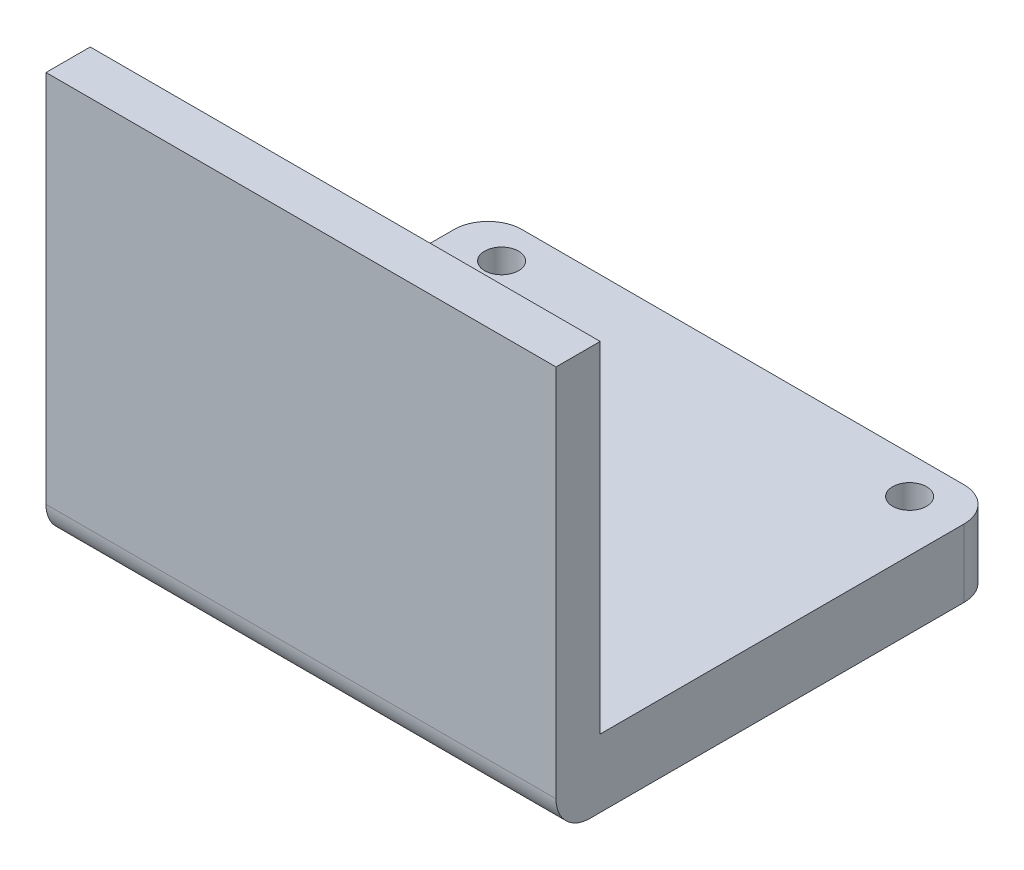
ISO-10303-21;
HEADER;
FILE_DESCRIPTION(('STEP AP214'),'2;1');
FILE_NAME('part.step','',(''),(''),'','','');
FILE_SCHEMA(('AUTOMOTIVE_DESIGN { 1 0 10303 214 1 1 1 1 }'));
ENDSEC;
DATA;
#1=APPLICATION_CONTEXT('core data for automotive mechanical design processes');
#2=APPLICATION_PROTOCOL_DEFINITION('international standard','automotive_design',2000,#1);
#3=PRODUCT_CONTEXT('',#1,'mechanical');
#4=PRODUCT('Part','Part','',(#3));
#5=PRODUCT_RELATED_PRODUCT_CATEGORY('part','',(#4));
#6=PRODUCT_DEFINITION_FORMATION('','',#4);
#7=PRODUCT_DEFINITION_CONTEXT('part definition',#1,'design');
#8=PRODUCT_DEFINITION('design','',#6,#7);
#9=PRODUCT_DEFINITION_SHAPE('','',#8);
#10=(LENGTH_UNIT() NAMED_UNIT(*) SI_UNIT(.MILLI.,.METRE.));
#11=(NAMED_UNIT(*) PLANE_ANGLE_UNIT() SI_UNIT($,.RADIAN.));
#12=(NAMED_UNIT(*) SI_UNIT($,.STERADIAN.) SOLID_ANGLE_UNIT());
#13=UNCERTAINTY_MEASURE_WITH_UNIT(LENGTH_MEASURE(1.E-05),#10,'distance_accuracy_value','');
#14=(GEOMETRIC_REPRESENTATION_CONTEXT(3) GLOBAL_UNCERTAINTY_ASSIGNED_CONTEXT((#13)) GLOBAL_UNIT_ASSIGNED_CONTEXT((#10,
#11,#12)) REPRESENTATION_CONTEXT('',''));
#15=CARTESIAN_POINT('',(0.,0.,0.));
#16=DIRECTION('',(0.,0.,1.));
#17=DIRECTION('',(1.,0.,0.));
#18=AXIS2_PLACEMENT_3D('',#15,#16,#17);
#19=CARTESIAN_POINT('',(0.,10.,0.));
#20=DIRECTION('',(0.,-1.,0.));
#21=DIRECTION('',(0.,0.,-1.));
#22=AXIS2_PLACEMENT_3D('',#19,#20,#21);
#23=PLANE('',#22);
#24=DIRECTION('',(0.,0.,-1.));
#25=VECTOR('',#24,1.);
#26=CARTESIAN_POINT('',(37.5,10.,27.5));
#27=LINE('',#26,#25);
#28=CARTESIAN_POINT('',(37.5,9.99999999999999,31.));
#29=VERTEX_POINT('',#28);
#30=CARTESIAN_POINT('',(37.5,10.,-22.5));
#31=VERTEX_POINT('',#30);
#32=EDGE_CURVE('E186',#29,#31,#27,.T.);
#33=ORIENTED_EDGE('',*,*,#32,.T.);
#34=CARTESIAN_POINT('',(32.5,10.,-22.5));
#35=DIRECTION('',(0.,-1.,0.));
#36=DIRECTION('',(0.,0.,-1.));
#37=AXIS2_PLACEMENT_3D('',#34,#35,#36);
#38=CIRCLE('',#37,5.);
#39=CARTESIAN_POINT('',(32.5,10.,-27.5));
#40=VERTEX_POINT('',#39);
#41=EDGE_CURVE('E50',#31,#40,#38,.F.);
#42=ORIENTED_EDGE('',*,*,#41,.T.);
#43=DIRECTION('',(-1.,0.,0.));
#44=VECTOR('',#43,1.);
#45=CARTESIAN_POINT('',(-37.5,10.,-27.5));
#46=LINE('',#45,#44);
#47=CARTESIAN_POINT('',(-32.5,10.,-27.5));
#48=VERTEX_POINT('',#47);
#49=EDGE_CURVE('E122',#40,#48,#46,.T.);
#50=ORIENTED_EDGE('',*,*,#49,.T.);
#51=CARTESIAN_POINT('',(-32.5,10.,-22.5));
#52=DIRECTION('',(0.,-1.,0.));
#53=DIRECTION('',(0.,0.,-1.));
#54=AXIS2_PLACEMENT_3D('',#51,#52,#53);
#55=CIRCLE('',#54,5.);
#56=CARTESIAN_POINT('',(-37.5,10.,-22.5));
#57=VERTEX_POINT('',#56);
#58=EDGE_CURVE('E57',#48,#57,#55,.F.);
#59=ORIENTED_EDGE('',*,*,#58,.T.);
#60=DIRECTION('',(0.,0.,1.));
#61=VECTOR('',#60,1.);
#62=CARTESIAN_POINT('',(-37.5,10.,27.5));
#63=LINE('',#62,#61);
#64=CARTESIAN_POINT('',(-37.5,9.99999999999999,31.));
#65=VERTEX_POINT('',#64);
#66=EDGE_CURVE('E113',#57,#65,#63,.T.);
#67=ORIENTED_EDGE('',*,*,#66,.T.);
#68=DIRECTION('',(1.,0.,0.));
#69=VECTOR('',#68,1.);
#70=CARTESIAN_POINT('',(-37.5,9.99999999999999,31.));
#71=LINE('',#70,#69);
#72=EDGE_CURVE('E116',#65,#29,#71,.T.);
#73=ORIENTED_EDGE('',*,*,#72,.T.);
#74=EDGE_LOOP('',(#33,#42,#50,#59,#67,#73));
#75=FACE_BOUND('',#74,.T.);
#76=CARTESIAN_POINT('',(-30.,10.,-22.));
#77=DIRECTION('',(0.,1.,0.));
#78=DIRECTION('',(0.,0.,1.));
#79=AXIS2_PLACEMENT_3D('',#76,#77,#78);
#80=CIRCLE('',#79,2.5);
#81=CARTESIAN_POINT('',(-30.,10.,-19.5));
#82=VERTEX_POINT('',#81);
#83=EDGE_CURVE('E178',#82,#82,#80,.T.);
#84=ORIENTED_EDGE('',*,*,#83,.F.);
#85=EDGE_LOOP('',(#84));
#86=FACE_BOUND('',#85,.T.);
#87=CARTESIAN_POINT('',(30.,10.,-22.));
#88=DIRECTION('',(0.,1.,0.));
#89=DIRECTION('',(0.,0.,1.));
#90=AXIS2_PLACEMENT_3D('',#87,#88,#89);
#91=CIRCLE('',#90,2.49999999999999);
#92=CARTESIAN_POINT('',(30.,10.,-19.5));
#93=VERTEX_POINT('',#92);
#94=EDGE_CURVE('E170',#93,#93,#91,.T.);
#95=ORIENTED_EDGE('',*,*,#94,.F.);
#96=EDGE_LOOP('',(#95));
#97=FACE_BOUND('',#96,.T.);
#98=CARTESIAN_POINT('',(0.,10.,18.));
#99=DIRECTION('',(0.,1.,0.));
#100=DIRECTION('',(0.,0.,1.));
#101=AXIS2_PLACEMENT_3D('',#98,#99,#100);
#102=CIRCLE('',#101,2.5);
#103=CARTESIAN_POINT('',(0.,10.,20.5));
#104=VERTEX_POINT('',#103);
#105=EDGE_CURVE('E162',#104,#104,#102,.T.);
#106=ORIENTED_EDGE('',*,*,#105,.F.);
#107=EDGE_LOOP('',(#106));
#108=FACE_BOUND('',#107,.T.);
#109=ADVANCED_FACE('F41',(#75,#86,#97,#108),#23,.F.);
#110=CARTESIAN_POINT('',(0.,0.,0.));
#111=DIRECTION('',(0.,-1.,0.));
#112=DIRECTION('',(0.,0.,-1.));
#113=AXIS2_PLACEMENT_3D('',#110,#111,#112);
#114=PLANE('',#113);
#115=CARTESIAN_POINT('',(30.,0.,-22.));
#116=DIRECTION('',(0.,1.,0.));
#117=DIRECTION('',(0.,0.,1.));
#118=AXIS2_PLACEMENT_3D('',#115,#116,#117);
#119=CIRCLE('',#118,2.49999999999999);
#120=CARTESIAN_POINT('',(30.,0.,-19.5));
#121=VERTEX_POINT('',#120);
#122=EDGE_CURVE('E166',#121,#121,#119,.T.);
#123=ORIENTED_EDGE('',*,*,#122,.T.);
#124=EDGE_LOOP('',(#123));
#125=FACE_BOUND('',#124,.T.);
#126=DIRECTION('',(-1.,0.,0.));
#127=VECTOR('',#126,1.);
#128=CARTESIAN_POINT('',(-37.5,0.,-27.5));
#129=LINE('',#128,#127);
#130=CARTESIAN_POINT('',(32.5,0.,-27.5));
#131=VERTEX_POINT('',#130);
#132=CARTESIAN_POINT('',(-32.5,0.,-27.5));
#133=VERTEX_POINT('',#132);
#134=EDGE_CURVE('E194',#131,#133,#129,.T.);
#135=ORIENTED_EDGE('',*,*,#134,.F.);
#136=CARTESIAN_POINT('',(32.5,0.,-22.5));
#137=DIRECTION('',(0.,-1.,0.));
#138=DIRECTION('',(0.,0.,-1.));
#139=AXIS2_PLACEMENT_3D('',#136,#137,#138);
#140=CIRCLE('',#139,5.);
#141=CARTESIAN_POINT('',(37.5,0.,-22.5));
#142=VERTEX_POINT('',#141);
#143=EDGE_CURVE('E223',#131,#142,#140,.T.);
#144=ORIENTED_EDGE('',*,*,#143,.T.);
#145=DIRECTION('',(0.,0.,-1.));
#146=VECTOR('',#145,1.);
#147=CARTESIAN_POINT('',(37.5,0.,27.5));
#148=LINE('',#147,#146);
#149=CARTESIAN_POINT('',(37.5,0.,32.5));
#150=VERTEX_POINT('',#149);
#151=EDGE_CURVE('E182',#150,#142,#148,.T.);
#152=ORIENTED_EDGE('',*,*,#151,.F.);
#153=DIRECTION('',(1.,0.,0.));
#154=VECTOR('',#153,1.);
#155=CARTESIAN_POINT('',(-37.5,0.,32.5));
#156=LINE('',#155,#154);
#157=CARTESIAN_POINT('',(-37.5,0.,32.5));
#158=VERTEX_POINT('',#157);
#159=EDGE_CURVE('E206',#150,#158,#156,.F.);
#160=ORIENTED_EDGE('',*,*,#159,.T.);
#161=DIRECTION('',(0.,0.,1.));
#162=VECTOR('',#161,1.);
#163=CARTESIAN_POINT('',(-37.5,0.,27.5));
#164=LINE('',#163,#162);
#165=CARTESIAN_POINT('',(-37.5,0.,-22.5));
#166=VERTEX_POINT('',#165);
#167=EDGE_CURVE('E189',#166,#158,#164,.T.);
#168=ORIENTED_EDGE('',*,*,#167,.F.);
#169=CARTESIAN_POINT('',(-32.5,0.,-22.5));
#170=DIRECTION('',(0.,-1.,0.));
#171=DIRECTION('',(0.,0.,-1.));
#172=AXIS2_PLACEMENT_3D('',#169,#170,#171);
#173=CIRCLE('',#172,5.);
#174=EDGE_CURVE('E220',#166,#133,#173,.T.);
#175=ORIENTED_EDGE('',*,*,#174,.T.);
#176=EDGE_LOOP('',(#135,#144,#152,#160,#168,#175));
#177=FACE_BOUND('',#176,.T.);
#178=CARTESIAN_POINT('',(-30.,0.,-22.));
#179=DIRECTION('',(0.,1.,0.));
#180=DIRECTION('',(0.,0.,1.));
#181=AXIS2_PLACEMENT_3D('',#178,#179,#180);
#182=CIRCLE('',#181,2.5);
#183=CARTESIAN_POINT('',(-30.,0.,-19.5));
#184=VERTEX_POINT('',#183);
#185=EDGE_CURVE('E174',#184,#184,#182,.T.);
#186=ORIENTED_EDGE('',*,*,#185,.T.);
#187=EDGE_LOOP('',(#186));
#188=FACE_BOUND('',#187,.T.);
#189=CARTESIAN_POINT('',(0.,0.,18.));
#190=DIRECTION('',(0.,1.,0.));
#191=DIRECTION('',(0.,0.,1.));
#192=AXIS2_PLACEMENT_3D('',#189,#190,#191);
#193=CIRCLE('',#192,2.5);
#194=CARTESIAN_POINT('',(0.,0.,20.5));
#195=VERTEX_POINT('',#194);
#196=EDGE_CURVE('E161',#195,#195,#193,.T.);
#197=ORIENTED_EDGE('',*,*,#196,.T.);
#198=EDGE_LOOP('',(#197));
#199=FACE_BOUND('',#198,.T.);
#200=ADVANCED_FACE('F241',(#125,#177,#188,#199),#114,.T.);
#201=CARTESIAN_POINT('',(37.5,10.,27.5));
#202=DIRECTION('',(-1.,0.,0.));
#203=DIRECTION('',(0.,0.,1.));
#204=AXIS2_PLACEMENT_3D('',#201,#202,#203);
#205=PLANE('',#204);
#206=ORIENTED_EDGE('',*,*,#151,.T.);
#207=DIRECTION('',(0.,-1.,0.));
#208=VECTOR('',#207,1.);
#209=CARTESIAN_POINT('',(37.5,10.,-22.5));
#210=LINE('',#209,#208);
#211=EDGE_CURVE('E65',#142,#31,#210,.F.);
#212=ORIENTED_EDGE('',*,*,#211,.T.);
#213=ORIENTED_EDGE('',*,*,#32,.F.);
#214=DIRECTION('',(0.,1.,0.));
#215=VECTOR('',#214,1.);
#216=CARTESIAN_POINT('',(37.5,9.99999999999999,31.));
#217=LINE('',#216,#215);
#218=CARTESIAN_POINT('',(37.5,60.,31.));
#219=VERTEX_POINT('',#218);
#220=EDGE_CURVE('E130',#29,#219,#217,.T.);
#221=ORIENTED_EDGE('',*,*,#220,.T.);
#222=DIRECTION('',(0.,0.,-1.));
#223=VECTOR('',#222,1.);
#224=CARTESIAN_POINT('',(37.5,60.,27.5));
#225=LINE('',#224,#223);
#226=CARTESIAN_POINT('',(37.5,60.,37.5));
#227=VERTEX_POINT('',#226);
#228=EDGE_CURVE('E149',#227,#219,#225,.T.);
#229=ORIENTED_EDGE('',*,*,#228,.F.);
#230=DIRECTION('',(0.,-1.,0.));
#231=VECTOR('',#230,1.);
#232=CARTESIAN_POINT('',(37.5,60.,37.5));
#233=LINE('',#232,#231);
#234=CARTESIAN_POINT('',(37.5,5.,37.5));
#235=VERTEX_POINT('',#234);
#236=EDGE_CURVE('E153',#227,#235,#233,.T.);
#237=ORIENTED_EDGE('',*,*,#236,.T.);
#238=CARTESIAN_POINT('',(37.5,5.,32.5));
#239=DIRECTION('',(-1.,0.,0.));
#240=DIRECTION('',(0.,0.,1.));
#241=AXIS2_PLACEMENT_3D('',#238,#239,#240);
#242=CIRCLE('',#241,5.);
#243=EDGE_CURVE('E203',#235,#150,#242,.F.);
#244=ORIENTED_EDGE('',*,*,#243,.T.);
#245=EDGE_LOOP('',(#206,#212,#213,#221,#229,#237,#244));
#246=FACE_BOUND('',#245,.T.);
#247=ADVANCED_FACE('F244',(#246),#205,.F.);
#248=CARTESIAN_POINT('',(-37.5,10.,-27.5));
#249=DIRECTION('',(0.,0.,1.));
#250=DIRECTION('',(1.,0.,0.));
#251=AXIS2_PLACEMENT_3D('',#248,#249,#250);
#252=PLANE('',#251);
#253=ORIENTED_EDGE('',*,*,#49,.F.);
#254=DIRECTION('',(0.,-1.,0.));
#255=VECTOR('',#254,1.);
#256=CARTESIAN_POINT('',(32.5,10.,-27.5));
#257=LINE('',#256,#255);
#258=EDGE_CURVE('E216',#40,#131,#257,.T.);
#259=ORIENTED_EDGE('',*,*,#258,.T.);
#260=ORIENTED_EDGE('',*,*,#134,.T.);
#261=DIRECTION('',(0.,-1.,0.));
#262=VECTOR('',#261,1.);
#263=CARTESIAN_POINT('',(-32.5,10.,-27.5));
#264=LINE('',#263,#262);
#265=EDGE_CURVE('E213',#133,#48,#264,.F.);
#266=ORIENTED_EDGE('',*,*,#265,.T.);
#267=EDGE_LOOP('',(#253,#259,#260,#266));
#268=FACE_BOUND('',#267,.T.);
#269=ADVANCED_FACE('F235',(#268),#252,.F.);
#270=CARTESIAN_POINT('',(-37.5,10.,27.5));
#271=DIRECTION('',(1.,0.,0.));
#272=DIRECTION('',(0.,0.,-1.));
#273=AXIS2_PLACEMENT_3D('',#270,#271,#272);
#274=PLANE('',#273);
#275=ORIENTED_EDGE('',*,*,#66,.F.);
#276=DIRECTION('',(0.,-1.,0.));
#277=VECTOR('',#276,1.);
#278=CARTESIAN_POINT('',(-37.5,10.,-22.5));
#279=LINE('',#278,#277);
#280=EDGE_CURVE('E11',#57,#166,#279,.T.);
#281=ORIENTED_EDGE('',*,*,#280,.T.);
#282=ORIENTED_EDGE('',*,*,#167,.T.);
#283=CARTESIAN_POINT('',(-37.5,5.,32.5));
#284=DIRECTION('',(1.,0.,0.));
#285=DIRECTION('',(0.,0.,-1.));
#286=AXIS2_PLACEMENT_3D('',#283,#284,#285);
#287=CIRCLE('',#286,5.);
#288=CARTESIAN_POINT('',(-37.5,5.,37.5));
#289=VERTEX_POINT('',#288);
#290=EDGE_CURVE('E210',#158,#289,#287,.F.);
#291=ORIENTED_EDGE('',*,*,#290,.T.);
#292=DIRECTION('',(0.,-1.,0.));
#293=VECTOR('',#292,1.);
#294=CARTESIAN_POINT('',(-37.5,60.,37.5));
#295=LINE('',#294,#293);
#296=CARTESIAN_POINT('',(-37.5,60.,37.5));
#297=VERTEX_POINT('',#296);
#298=EDGE_CURVE('E157',#297,#289,#295,.T.);
#299=ORIENTED_EDGE('',*,*,#298,.F.);
#300=DIRECTION('',(0.,0.,1.));
#301=VECTOR('',#300,1.);
#302=CARTESIAN_POINT('',(-37.5,60.,27.5));
#303=LINE('',#302,#301);
#304=CARTESIAN_POINT('',(-37.5,60.,31.));
#305=VERTEX_POINT('',#304);
#306=EDGE_CURVE('E137',#305,#297,#303,.T.);
#307=ORIENTED_EDGE('',*,*,#306,.F.);
#308=DIRECTION('',(0.,1.,0.));
#309=VECTOR('',#308,1.);
#310=CARTESIAN_POINT('',(-37.5,9.99999999999999,31.));
#311=LINE('',#310,#309);
#312=EDGE_CURVE('E127',#65,#305,#311,.T.);
#313=ORIENTED_EDGE('',*,*,#312,.F.);
#314=EDGE_LOOP('',(#275,#281,#282,#291,#299,#307,#313));
#315=FACE_BOUND('',#314,.T.);
#316=ADVANCED_FACE('F135',(#315),#274,.F.);
#317=CARTESIAN_POINT('',(-30.,10.,-22.));
#318=DIRECTION('',(0.,-1.,0.));
#319=DIRECTION('',(0.,0.,-1.));
#320=AXIS2_PLACEMENT_3D('',#317,#318,#319);
#321=CYLINDRICAL_SURFACE('',#320,2.5);
#322=ORIENTED_EDGE('',*,*,#83,.T.);
#323=EDGE_LOOP('',(#322));
#324=FACE_BOUND('',#323,.T.);
#325=ORIENTED_EDGE('',*,*,#185,.F.);
#326=EDGE_LOOP('',(#325));
#327=FACE_BOUND('',#326,.T.);
#328=ADVANCED_FACE('F268',(#324,#327),#321,.F.);
#329=CARTESIAN_POINT('',(30.,10.,-22.));
#330=DIRECTION('',(0.,-1.,0.));
#331=DIRECTION('',(0.,0.,-1.));
#332=AXIS2_PLACEMENT_3D('',#329,#330,#331);
#333=CYLINDRICAL_SURFACE('',#332,2.49999999999999);
#334=ORIENTED_EDGE('',*,*,#94,.T.);
#335=EDGE_LOOP('',(#334));
#336=FACE_BOUND('',#335,.T.);
#337=ORIENTED_EDGE('',*,*,#122,.F.);
#338=EDGE_LOOP('',(#337));
#339=FACE_BOUND('',#338,.T.);
#340=ADVANCED_FACE('F293',(#336,#339),#333,.F.);
#341=CARTESIAN_POINT('',(0.,10.,18.));
#342=DIRECTION('',(0.,-1.,0.));
#343=DIRECTION('',(0.,0.,-1.));
#344=AXIS2_PLACEMENT_3D('',#341,#342,#343);
#345=CYLINDRICAL_SURFACE('',#344,2.5);
#346=ORIENTED_EDGE('',*,*,#105,.T.);
#347=EDGE_LOOP('',(#346));
#348=FACE_BOUND('',#347,.T.);
#349=ORIENTED_EDGE('',*,*,#196,.F.);
#350=EDGE_LOOP('',(#349));
#351=FACE_BOUND('',#350,.T.);
#352=ADVANCED_FACE('F291',(#348,#351),#345,.F.);
#353=CARTESIAN_POINT('',(-37.5,60.,37.5));
#354=DIRECTION('',(0.,0.,-1.));
#355=DIRECTION('',(-1.,0.,0.));
#356=AXIS2_PLACEMENT_3D('',#353,#354,#355);
#357=PLANE('',#356);
#358=ORIENTED_EDGE('',*,*,#298,.T.);
#359=DIRECTION('',(1.,0.,0.));
#360=VECTOR('',#359,1.);
#361=CARTESIAN_POINT('',(37.5,5.,37.5));
#362=LINE('',#361,#360);
#363=EDGE_CURVE('E121',#289,#235,#362,.T.);
#364=ORIENTED_EDGE('',*,*,#363,.T.);
#365=ORIENTED_EDGE('',*,*,#236,.F.);
#366=DIRECTION('',(1.,0.,0.));
#367=VECTOR('',#366,1.);
#368=CARTESIAN_POINT('',(-37.5,60.,37.5));
#369=LINE('',#368,#367);
#370=EDGE_CURVE('E146',#297,#227,#369,.T.);
#371=ORIENTED_EDGE('',*,*,#370,.F.);
#372=EDGE_LOOP('',(#358,#364,#365,#371));
#373=FACE_BOUND('',#372,.T.);
#374=ADVANCED_FACE('F252',(#373),#357,.F.);
#375=CARTESIAN_POINT('',(0.,60.,0.));
#376=DIRECTION('',(0.,1.,0.));
#377=DIRECTION('',(0.,0.,1.));
#378=AXIS2_PLACEMENT_3D('',#375,#376,#377);
#379=PLANE('',#378);
#380=DIRECTION('',(1.,0.,0.));
#381=VECTOR('',#380,1.);
#382=CARTESIAN_POINT('',(-37.5,60.,31.));
#383=LINE('',#382,#381);
#384=EDGE_CURVE('E132',#305,#219,#383,.T.);
#385=ORIENTED_EDGE('',*,*,#384,.F.);
#386=ORIENTED_EDGE('',*,*,#306,.T.);
#387=ORIENTED_EDGE('',*,*,#370,.T.);
#388=ORIENTED_EDGE('',*,*,#228,.T.);
#389=EDGE_LOOP('',(#385,#386,#387,#388));
#390=FACE_BOUND('',#389,.T.);
#391=ADVANCED_FACE('F281',(#390),#379,.T.);
#392=CARTESIAN_POINT('',(-37.5,9.99999999999999,31.));
#393=DIRECTION('',(0.,0.,1.));
#394=DIRECTION('',(1.,0.,0.));
#395=AXIS2_PLACEMENT_3D('',#392,#393,#394);
#396=PLANE('',#395);
#397=ORIENTED_EDGE('',*,*,#384,.T.);
#398=ORIENTED_EDGE('',*,*,#220,.F.);
#399=ORIENTED_EDGE('',*,*,#72,.F.);
#400=ORIENTED_EDGE('',*,*,#312,.T.);
#401=EDGE_LOOP('',(#397,#398,#399,#400));
#402=FACE_BOUND('',#401,.T.);
#403=ADVANCED_FACE('F126',(#402),#396,.F.);
#404=CARTESIAN_POINT('',(-37.5,5.,32.5));
#405=DIRECTION('',(-1.,0.,0.));
#406=DIRECTION('',(0.,0.,1.));
#407=AXIS2_PLACEMENT_3D('',#404,#405,#406);
#408=CYLINDRICAL_SURFACE('',#407,5.);
#409=ORIENTED_EDGE('',*,*,#290,.F.);
#410=ORIENTED_EDGE('',*,*,#159,.F.);
#411=ORIENTED_EDGE('',*,*,#243,.F.);
#412=ORIENTED_EDGE('',*,*,#363,.F.);
#413=EDGE_LOOP('',(#409,#410,#411,#412));
#414=FACE_BOUND('',#413,.T.);
#415=ADVANCED_FACE('F250',(#414),#408,.T.);
#416=CARTESIAN_POINT('',(32.5,10.,-22.5));
#417=DIRECTION('',(0.,-1.,0.));
#418=DIRECTION('',(0.,0.,-1.));
#419=AXIS2_PLACEMENT_3D('',#416,#417,#418);
#420=CYLINDRICAL_SURFACE('',#419,5.);
#421=ORIENTED_EDGE('',*,*,#41,.F.);
#422=ORIENTED_EDGE('',*,*,#211,.F.);
#423=ORIENTED_EDGE('',*,*,#143,.F.);
#424=ORIENTED_EDGE('',*,*,#258,.F.);
#425=EDGE_LOOP('',(#421,#422,#423,#424));
#426=FACE_BOUND('',#425,.T.);
#427=ADVANCED_FACE('F238',(#426),#420,.T.);
#428=CARTESIAN_POINT('',(-32.5,10.,-22.5));
#429=DIRECTION('',(0.,-1.,0.));
#430=DIRECTION('',(0.,0.,-1.));
#431=AXIS2_PLACEMENT_3D('',#428,#429,#430);
#432=CYLINDRICAL_SURFACE('',#431,5.);
#433=ORIENTED_EDGE('',*,*,#58,.F.);
#434=ORIENTED_EDGE('',*,*,#265,.F.);
#435=ORIENTED_EDGE('',*,*,#174,.F.);
#436=ORIENTED_EDGE('',*,*,#280,.F.);
#437=EDGE_LOOP('',(#433,#434,#435,#436));
#438=FACE_BOUND('',#437,.T.);
#439=ADVANCED_FACE('F43',(#438),#432,.T.);
#440=CLOSED_SHELL('',(#109,#200,#247,#269,#316,#328,#340,#352,#374,#391,#403,#415,#427,#439));
#441=MANIFOLD_SOLID_BREP('B2',#440);
#442=ADVANCED_BREP_SHAPE_REPRESENTATION('',(#18,#441),#14);
#443=SHAPE_DEFINITION_REPRESENTATION(#9,#442);
ENDSEC;
END-ISO-10303-21;
